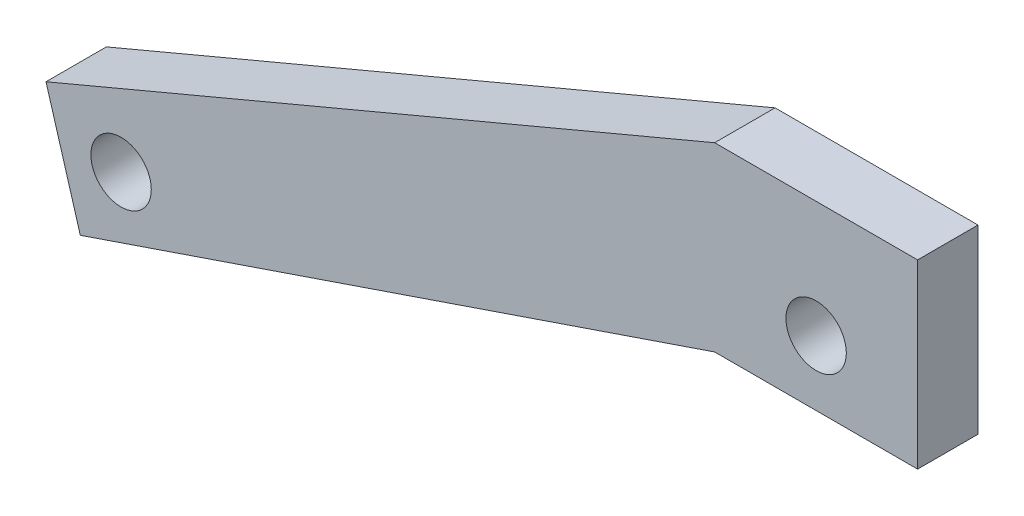
ISO-10303-21;
HEADER;
FILE_DESCRIPTION(('STEP AP214'),'2;1');
FILE_NAME('part.step','',(''),(''),'','','');
FILE_SCHEMA(('AUTOMOTIVE_DESIGN { 1 0 10303 214 1 1 1 1 }'));
ENDSEC;
DATA;
#1=APPLICATION_CONTEXT('core data for automotive mechanical design processes');
#2=APPLICATION_PROTOCOL_DEFINITION('international standard','automotive_design',2000,#1);
#3=PRODUCT_CONTEXT('',#1,'mechanical');
#4=PRODUCT('Part','Part','',(#3));
#5=PRODUCT_RELATED_PRODUCT_CATEGORY('part','',(#4));
#6=PRODUCT_DEFINITION_FORMATION('','',#4);
#7=PRODUCT_DEFINITION_CONTEXT('part definition',#1,'design');
#8=PRODUCT_DEFINITION('design','',#6,#7);
#9=PRODUCT_DEFINITION_SHAPE('','',#8);
#10=(LENGTH_UNIT() NAMED_UNIT(*) SI_UNIT(.MILLI.,.METRE.));
#11=(NAMED_UNIT(*) PLANE_ANGLE_UNIT() SI_UNIT($,.RADIAN.));
#12=(NAMED_UNIT(*) SI_UNIT($,.STERADIAN.) SOLID_ANGLE_UNIT());
#13=UNCERTAINTY_MEASURE_WITH_UNIT(LENGTH_MEASURE(1.E-05),#10,'distance_accuracy_value','');
#14=(GEOMETRIC_REPRESENTATION_CONTEXT(3) GLOBAL_UNCERTAINTY_ASSIGNED_CONTEXT((#13)) GLOBAL_UNIT_ASSIGNED_CONTEXT((#10,
#11,#12)) REPRESENTATION_CONTEXT('',''));
#15=CARTESIAN_POINT('',(0.,0.,0.));
#16=DIRECTION('',(0.,0.,1.));
#17=DIRECTION('',(1.,0.,0.));
#18=AXIS2_PLACEMENT_3D('',#15,#16,#17);
#19=CARTESIAN_POINT('',(-181.897226624623,-53.8804132223541,9.525));
#20=DIRECTION('',(-0.958819734868243,-0.284015344703754,0.));
#21=DIRECTION('',(0.284015344703754,-0.958819734868243,0.));
#22=AXIS2_PLACEMENT_3D('',#19,#20,#21);
#23=PLANE('',#22);
#24=DIRECTION('',(-0.284015344703754,0.958819734868243,0.));
#25=VECTOR('',#24,1.);
#26=CARTESIAN_POINT('',(-181.897226624623,-53.8804132223541,0.));
#27=LINE('',#26,#25);
#28=CARTESIAN_POINT('',(-211.250903159401,45.2159380041662,0.));
#29=VERTEX_POINT('',#28);
#30=CARTESIAN_POINT('',(-216.661395476008,63.4814539534063,0.));
#31=VERTEX_POINT('',#30);
#32=EDGE_CURVE('E129',#29,#31,#27,.T.);
#33=ORIENTED_EDGE('',*,*,#32,.F.);
#34=DIRECTION('',(0.,0.,-1.));
#35=VECTOR('',#34,1.);
#36=CARTESIAN_POINT('',(-211.250903159401,45.2159380041662,9.525));
#37=LINE('',#36,#35);
#38=CARTESIAN_POINT('',(-211.250903159401,45.2159380041662,9.525));
#39=VERTEX_POINT('',#38);
#40=EDGE_CURVE('E11',#39,#29,#37,.T.);
#41=ORIENTED_EDGE('',*,*,#40,.F.);
#42=DIRECTION('',(-0.284015344703754,0.958819734868243,0.));
#43=VECTOR('',#42,1.);
#44=CARTESIAN_POINT('',(-181.897226624623,-53.8804132223541,9.525));
#45=LINE('',#44,#43);
#46=CARTESIAN_POINT('',(-216.661395476008,63.4814539534063,9.525));
#47=VERTEX_POINT('',#46);
#48=EDGE_CURVE('E237',#39,#47,#45,.T.);
#49=ORIENTED_EDGE('',*,*,#48,.T.);
#50=DIRECTION('',(0.,0.,-1.));
#51=VECTOR('',#50,1.);
#52=CARTESIAN_POINT('',(-216.661395476008,63.4814539534063,9.525));
#53=LINE('',#52,#51);
#54=EDGE_CURVE('E79',#47,#31,#53,.T.);
#55=ORIENTED_EDGE('',*,*,#54,.T.);
#56=EDGE_LOOP('',(#33,#41,#49,#55));
#57=FACE_BOUND('',#56,.T.);
#58=ADVANCED_FACE('F34',(#57),#23,.T.);
#59=CARTESIAN_POINT('',(-35.7758008350263,105.002644647187,9.525));
#60=DIRECTION('',(0.322507916242878,-0.946566766773838,0.));
#61=DIRECTION('',(0.946566766773838,0.322507916242878,0.));
#62=AXIS2_PLACEMENT_3D('',#59,#60,#61);
#63=PLANE('',#62);
#64=DIRECTION('',(-0.946566766773838,-0.322507916242878,0.));
#65=VECTOR('',#64,1.);
#66=CARTESIAN_POINT('',(-35.7758008350263,105.002644647187,0.));
#67=LINE('',#66,#65);
#68=CARTESIAN_POINT('',(-111.230275822276,79.2942991257426,0.));
#69=VERTEX_POINT('',#68);
#70=EDGE_CURVE('E127',#69,#29,#67,.T.);
#71=ORIENTED_EDGE('',*,*,#70,.F.);
#72=DIRECTION('',(0.,0.,-1.));
#73=VECTOR('',#72,1.);
#74=CARTESIAN_POINT('',(-111.230275822276,79.2942991257426,9.525));
#75=LINE('',#74,#73);
#76=CARTESIAN_POINT('',(-111.230275822276,79.2942991257426,9.525));
#77=VERTEX_POINT('',#76);
#78=EDGE_CURVE('E43',#77,#69,#75,.T.);
#79=ORIENTED_EDGE('',*,*,#78,.F.);
#80=DIRECTION('',(-0.946566766773838,-0.322507916242878,0.));
#81=VECTOR('',#80,1.);
#82=CARTESIAN_POINT('',(-35.7758008350263,105.002644647187,9.525));
#83=LINE('',#82,#81);
#84=EDGE_CURVE('E238',#77,#39,#83,.T.);
#85=ORIENTED_EDGE('',*,*,#84,.T.);
#86=ORIENTED_EDGE('',*,*,#40,.T.);
#87=EDGE_LOOP('',(#71,#79,#85,#86));
#88=FACE_BOUND('',#87,.T.);
#89=ADVANCED_FACE('F128',(#88),#63,.T.);
#90=CARTESIAN_POINT('',(0.,79.2942991257426,9.525));
#91=DIRECTION('',(0.,-1.,0.));
#92=DIRECTION('',(1.,0.,0.));
#93=AXIS2_PLACEMENT_3D('',#90,#91,#92);
#94=PLANE('',#93);
#95=DIRECTION('',(-1.,0.,0.));
#96=VECTOR('',#95,1.);
#97=CARTESIAN_POINT('',(0.,79.2942991257426,0.));
#98=LINE('',#97,#96);
#99=CARTESIAN_POINT('',(-79.2302758222756,79.2942991257426,0.));
#100=VERTEX_POINT('',#99);
#101=EDGE_CURVE('E123',#100,#69,#98,.T.);
#102=ORIENTED_EDGE('',*,*,#101,.F.);
#103=DIRECTION('',(0.,0.,-1.));
#104=VECTOR('',#103,1.);
#105=CARTESIAN_POINT('',(-79.2302758222756,79.2942991257426,9.525));
#106=LINE('',#105,#104);
#107=CARTESIAN_POINT('',(-79.2302758222756,79.2942991257426,9.525));
#108=VERTEX_POINT('',#107);
#109=EDGE_CURVE('E113',#108,#100,#106,.T.);
#110=ORIENTED_EDGE('',*,*,#109,.F.);
#111=DIRECTION('',(-1.,0.,0.));
#112=VECTOR('',#111,1.);
#113=CARTESIAN_POINT('',(0.,79.2942991257426,9.525));
#114=LINE('',#113,#112);
#115=EDGE_CURVE('E107',#108,#77,#114,.T.);
#116=ORIENTED_EDGE('',*,*,#115,.T.);
#117=ORIENTED_EDGE('',*,*,#78,.T.);
#118=EDGE_LOOP('',(#102,#110,#116,#117));
#119=FACE_BOUND('',#118,.T.);
#120=ADVANCED_FACE('F121',(#119),#94,.T.);
#121=CARTESIAN_POINT('',(-79.2302758222756,0.,9.525));
#122=DIRECTION('',(-1.,0.,0.));
#123=DIRECTION('',(0.,-1.,0.));
#124=AXIS2_PLACEMENT_3D('',#121,#122,#123);
#125=PLANE('',#124);
#126=DIRECTION('',(0.,1.,0.));
#127=VECTOR('',#126,1.);
#128=CARTESIAN_POINT('',(-79.2302758222756,0.,0.));
#129=LINE('',#128,#127);
#130=CARTESIAN_POINT('',(-79.2302758222756,107.869299125743,0.));
#131=VERTEX_POINT('',#130);
#132=EDGE_CURVE('E112',#100,#131,#129,.T.);
#133=ORIENTED_EDGE('',*,*,#132,.T.);
#134=DIRECTION('',(0.,0.,-1.));
#135=VECTOR('',#134,1.);
#136=CARTESIAN_POINT('',(-79.2302758222756,107.869299125743,9.525));
#137=LINE('',#136,#135);
#138=CARTESIAN_POINT('',(-79.2302758222756,107.869299125743,9.525));
#139=VERTEX_POINT('',#138);
#140=EDGE_CURVE('E97',#139,#131,#137,.T.);
#141=ORIENTED_EDGE('',*,*,#140,.F.);
#142=DIRECTION('',(0.,1.,0.));
#143=VECTOR('',#142,1.);
#144=CARTESIAN_POINT('',(-79.2302758222756,0.,9.525));
#145=LINE('',#144,#143);
#146=EDGE_CURVE('E100',#108,#139,#145,.T.);
#147=ORIENTED_EDGE('',*,*,#146,.F.);
#148=ORIENTED_EDGE('',*,*,#109,.T.);
#149=EDGE_LOOP('',(#133,#141,#147,#148));
#150=FACE_BOUND('',#149,.T.);
#151=ADVANCED_FACE('F110',(#150),#125,.F.);
#152=CARTESIAN_POINT('',(1.77767235254067E-11,107.86929912573,9.525));
#153=DIRECTION('',(-1.64798730217823E-13,-1.,0.));
#154=DIRECTION('',(1.,-1.64798730217823E-13,0.));
#155=AXIS2_PLACEMENT_3D('',#152,#153,#154);
#156=PLANE('',#155);
#157=DIRECTION('',(-1.,1.64798730217823E-13,0.));
#158=VECTOR('',#157,1.);
#159=CARTESIAN_POINT('',(1.77767235254067E-11,107.86929912573,0.));
#160=LINE('',#159,#158);
#161=CARTESIAN_POINT('',(-111.230275822271,107.869299125748,0.));
#162=VERTEX_POINT('',#161);
#163=EDGE_CURVE('E133',#131,#162,#160,.T.);
#164=ORIENTED_EDGE('',*,*,#163,.T.);
#165=DIRECTION('',(0.,0.,-1.));
#166=VECTOR('',#165,1.);
#167=CARTESIAN_POINT('',(-111.230275822271,107.869299125748,9.525));
#168=LINE('',#167,#166);
#169=CARTESIAN_POINT('',(-111.230275822271,107.869299125748,9.525));
#170=VERTEX_POINT('',#169);
#171=EDGE_CURVE('E99',#170,#162,#168,.T.);
#172=ORIENTED_EDGE('',*,*,#171,.F.);
#173=DIRECTION('',(-1.,1.64798730217823E-13,0.));
#174=VECTOR('',#173,1.);
#175=CARTESIAN_POINT('',(1.77767235254067E-11,107.86929912573,9.525));
#176=LINE('',#175,#174);
#177=EDGE_CURVE('E92',#139,#170,#176,.T.);
#178=ORIENTED_EDGE('',*,*,#177,.F.);
#179=ORIENTED_EDGE('',*,*,#140,.T.);
#180=EDGE_LOOP('',(#164,#172,#178,#179));
#181=FACE_BOUND('',#180,.T.);
#182=ADVANCED_FACE('F95',(#181),#156,.F.);
#183=CARTESIAN_POINT('',(-95.2302956476441,89.5168960367285,9.525));
#184=DIRECTION('',(0.,0.,-1.));
#185=DIRECTION('',(-1.,0.,0.));
#186=AXIS2_PLACEMENT_3D('',#183,#184,#185);
#187=CYLINDRICAL_SURFACE('',#186,4.76250000164186);
#188=CARTESIAN_POINT('',(-95.2302956476441,89.5168960367285,9.525));
#189=DIRECTION('',(0.,0.,1.));
#190=DIRECTION('',(1.,0.,0.));
#191=AXIS2_PLACEMENT_3D('',#188,#189,#190);
#192=CIRCLE('',#191,4.76250000164186);
#193=CARTESIAN_POINT('',(-90.4677956460023,89.5168960367285,9.525));
#194=VERTEX_POINT('',#193);
#195=EDGE_CURVE('E166',#194,#194,#192,.T.);
#196=ORIENTED_EDGE('',*,*,#195,.T.);
#197=EDGE_LOOP('',(#196));
#198=FACE_BOUND('',#197,.T.);
#199=CARTESIAN_POINT('',(-95.2302956476441,89.5168960367285,0.));
#200=DIRECTION('',(0.,0.,1.));
#201=DIRECTION('',(1.,0.,0.));
#202=AXIS2_PLACEMENT_3D('',#199,#200,#201);
#203=CIRCLE('',#202,4.76250000164186);
#204=CARTESIAN_POINT('',(-90.4677956460023,89.5168960367285,0.));
#205=VERTEX_POINT('',#204);
#206=EDGE_CURVE('E144',#205,#205,#203,.T.);
#207=ORIENTED_EDGE('',*,*,#206,.F.);
#208=EDGE_LOOP('',(#207));
#209=FACE_BOUND('',#208,.T.);
#210=ADVANCED_FACE('F153',(#198,#209),#187,.F.);
#211=CARTESIAN_POINT('',(-204.823391343084,57.0539421370895,9.525));
#212=DIRECTION('',(0.,0.,-1.));
#213=DIRECTION('',(-1.,0.,0.));
#214=AXIS2_PLACEMENT_3D('',#211,#212,#213);
#215=CYLINDRICAL_SURFACE('',#214,4.76250000164186);
#216=CARTESIAN_POINT('',(-204.823391343084,57.0539421370895,9.525));
#217=DIRECTION('',(0.,0.,1.));
#218=DIRECTION('',(1.,0.,0.));
#219=AXIS2_PLACEMENT_3D('',#216,#217,#218);
#220=CIRCLE('',#219,4.76250000164186);
#221=CARTESIAN_POINT('',(-200.060891341442,57.0539421370895,9.525));
#222=VERTEX_POINT('',#221);
#223=EDGE_CURVE('E138',#222,#222,#220,.T.);
#224=ORIENTED_EDGE('',*,*,#223,.T.);
#225=EDGE_LOOP('',(#224));
#226=FACE_BOUND('',#225,.T.);
#227=CARTESIAN_POINT('',(-204.823391343084,57.0539421370895,0.));
#228=DIRECTION('',(0.,0.,1.));
#229=DIRECTION('',(1.,0.,0.));
#230=AXIS2_PLACEMENT_3D('',#227,#228,#229);
#231=CIRCLE('',#230,4.76250000164186);
#232=CARTESIAN_POINT('',(-200.060891341442,57.0539421370895,0.));
#233=VERTEX_POINT('',#232);
#234=EDGE_CURVE('E141',#233,#233,#231,.T.);
#235=ORIENTED_EDGE('',*,*,#234,.F.);
#236=EDGE_LOOP('',(#235));
#237=FACE_BOUND('',#236,.T.);
#238=ADVANCED_FACE('F36',(#226,#237),#215,.F.);
#239=CARTESIAN_POINT('',(-55.3238590191712,131.40661316876,9.525));
#240=DIRECTION('',(0.388025774847095,-0.921648521972618,0.));
#241=DIRECTION('',(0.921648521972618,0.388025774847095,0.));
#242=AXIS2_PLACEMENT_3D('',#239,#240,#241);
#243=PLANE('',#242);
#244=DIRECTION('',(-0.921648521972618,-0.388025774847095,0.));
#245=VECTOR('',#244,1.);
#246=CARTESIAN_POINT('',(-55.3238590191712,131.40661316876,0.));
#247=LINE('',#246,#245);
#248=EDGE_CURVE('E72',#162,#31,#247,.T.);
#249=ORIENTED_EDGE('',*,*,#248,.T.);
#250=ORIENTED_EDGE('',*,*,#54,.F.);
#251=DIRECTION('',(-0.921648521972618,-0.388025774847095,0.));
#252=VECTOR('',#251,1.);
#253=CARTESIAN_POINT('',(-55.3238590191712,131.40661316876,9.525));
#254=LINE('',#253,#252);
#255=EDGE_CURVE('E51',#170,#47,#254,.T.);
#256=ORIENTED_EDGE('',*,*,#255,.F.);
#257=ORIENTED_EDGE('',*,*,#171,.T.);
#258=EDGE_LOOP('',(#249,#250,#256,#257));
#259=FACE_BOUND('',#258,.T.);
#260=ADVANCED_FACE('F160',(#259),#243,.F.);
#261=CARTESIAN_POINT('',(0.,0.,9.525));
#262=DIRECTION('',(0.,0.,1.));
#263=DIRECTION('',(1.,0.,0.));
#264=AXIS2_PLACEMENT_3D('',#261,#262,#263);
#265=PLANE('',#264);
#266=ORIENTED_EDGE('',*,*,#223,.F.);
#267=EDGE_LOOP('',(#266));
#268=FACE_BOUND('',#267,.T.);
#269=ORIENTED_EDGE('',*,*,#195,.F.);
#270=EDGE_LOOP('',(#269));
#271=FACE_BOUND('',#270,.T.);
#272=ORIENTED_EDGE('',*,*,#48,.F.);
#273=ORIENTED_EDGE('',*,*,#84,.F.);
#274=ORIENTED_EDGE('',*,*,#115,.F.);
#275=ORIENTED_EDGE('',*,*,#146,.T.);
#276=ORIENTED_EDGE('',*,*,#177,.T.);
#277=ORIENTED_EDGE('',*,*,#255,.T.);
#278=EDGE_LOOP('',(#272,#273,#274,#275,#276,#277));
#279=FACE_BOUND('',#278,.T.);
#280=ADVANCED_FACE('F104',(#268,#271,#279),#265,.T.);
#281=CARTESIAN_POINT('',(0.,0.,0.));
#282=DIRECTION('',(0.,0.,1.));
#283=DIRECTION('',(1.,0.,0.));
#284=AXIS2_PLACEMENT_3D('',#281,#282,#283);
#285=PLANE('',#284);
#286=ORIENTED_EDGE('',*,*,#234,.T.);
#287=EDGE_LOOP('',(#286));
#288=FACE_BOUND('',#287,.T.);
#289=ORIENTED_EDGE('',*,*,#206,.T.);
#290=EDGE_LOOP('',(#289));
#291=FACE_BOUND('',#290,.T.);
#292=ORIENTED_EDGE('',*,*,#32,.T.);
#293=ORIENTED_EDGE('',*,*,#248,.F.);
#294=ORIENTED_EDGE('',*,*,#163,.F.);
#295=ORIENTED_EDGE('',*,*,#132,.F.);
#296=ORIENTED_EDGE('',*,*,#101,.T.);
#297=ORIENTED_EDGE('',*,*,#70,.T.);
#298=EDGE_LOOP('',(#292,#293,#294,#295,#296,#297));
#299=FACE_BOUND('',#298,.T.);
#300=ADVANCED_FACE('F131',(#288,#291,#299),#285,.F.);
#301=CLOSED_SHELL('',(#58,#89,#120,#151,#182,#210,#238,#260,#280,#300));
#302=MANIFOLD_SOLID_BREP('B2',#301);
#303=ADVANCED_BREP_SHAPE_REPRESENTATION('',(#18,#302),#14);
#304=SHAPE_DEFINITION_REPRESENTATION(#9,#303);
ENDSEC;
END-ISO-10303-21;
